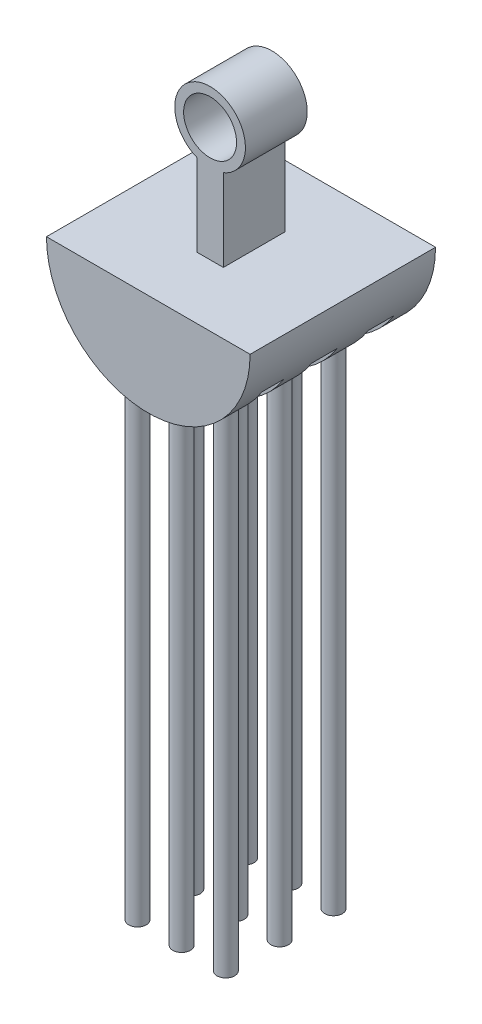
ISO-10303-21;
HEADER;
FILE_DESCRIPTION(('STEP AP214'),'2;1');
FILE_NAME('part.step','',(''),(''),'','','');
FILE_SCHEMA(('AUTOMOTIVE_DESIGN { 1 0 10303 214 1 1 1 1 }'));
ENDSEC;
DATA;
#1=APPLICATION_CONTEXT('core data for automotive mechanical design processes');
#2=APPLICATION_PROTOCOL_DEFINITION('international standard','automotive_design',2000,#1);
#3=PRODUCT_CONTEXT('',#1,'mechanical');
#4=PRODUCT('Part','Part','',(#3));
#5=PRODUCT_RELATED_PRODUCT_CATEGORY('part','',(#4));
#6=PRODUCT_DEFINITION_FORMATION('','',#4);
#7=PRODUCT_DEFINITION_CONTEXT('part definition',#1,'design');
#8=PRODUCT_DEFINITION('design','',#6,#7);
#9=PRODUCT_DEFINITION_SHAPE('','',#8);
#10=(LENGTH_UNIT() NAMED_UNIT(*) SI_UNIT(.MILLI.,.METRE.));
#11=(NAMED_UNIT(*) PLANE_ANGLE_UNIT() SI_UNIT($,.RADIAN.));
#12=(NAMED_UNIT(*) SI_UNIT($,.STERADIAN.) SOLID_ANGLE_UNIT());
#13=UNCERTAINTY_MEASURE_WITH_UNIT(LENGTH_MEASURE(1.E-05),#10,'distance_accuracy_value','');
#14=(GEOMETRIC_REPRESENTATION_CONTEXT(3) GLOBAL_UNCERTAINTY_ASSIGNED_CONTEXT((#13)) GLOBAL_UNIT_ASSIGNED_CONTEXT((#10,
#11,#12)) REPRESENTATION_CONTEXT('',''));
#15=CARTESIAN_POINT('',(0.,0.,0.));
#16=DIRECTION('',(0.,0.,1.));
#17=DIRECTION('',(1.,0.,0.));
#18=AXIS2_PLACEMENT_3D('',#15,#16,#17);
#19=CARTESIAN_POINT('',(0.,0.,7.));
#20=DIRECTION('',(0.,0.,1.));
#21=DIRECTION('',(1.,0.,0.));
#22=AXIS2_PLACEMENT_3D('',#19,#20,#21);
#23=PLANE('',#22);
#24=CARTESIAN_POINT('',(0.,0.,7.));
#25=DIRECTION('',(0.,0.,1.));
#26=DIRECTION('',(1.,0.,0.));
#27=AXIS2_PLACEMENT_3D('',#24,#25,#26);
#28=CIRCLE('',#27,4.);
#29=CARTESIAN_POINT('',(1.5,-3.70809924354783,7.));
#30=VERTEX_POINT('',#29);
#31=CARTESIAN_POINT('',(-1.5,-3.70809924354783,7.));
#32=VERTEX_POINT('',#31);
#33=EDGE_CURVE('E571',#30,#32,#28,.T.);
#34=ORIENTED_EDGE('',*,*,#33,.T.);
#35=DIRECTION('',(0.,-1.,0.));
#36=VECTOR('',#35,1.);
#37=CARTESIAN_POINT('',(-1.5,-3.,7.));
#38=LINE('',#37,#36);
#39=CARTESIAN_POINT('',(-1.5,-13.,7.));
#40=VERTEX_POINT('',#39);
#41=EDGE_CURVE('E543',#32,#40,#38,.T.);
#42=ORIENTED_EDGE('',*,*,#41,.T.);
#43=DIRECTION('',(1.,0.,0.));
#44=VECTOR('',#43,1.);
#45=CARTESIAN_POINT('',(-1.5,-13.,7.));
#46=LINE('',#45,#44);
#47=CARTESIAN_POINT('',(1.5,-13.,7.));
#48=VERTEX_POINT('',#47);
#49=EDGE_CURVE('E556',#40,#48,#46,.T.);
#50=ORIENTED_EDGE('',*,*,#49,.T.);
#51=DIRECTION('',(0.,1.,0.));
#52=VECTOR('',#51,1.);
#53=CARTESIAN_POINT('',(1.5,-13.,7.));
#54=LINE('',#53,#52);
#55=EDGE_CURVE('E549',#48,#30,#54,.T.);
#56=ORIENTED_EDGE('',*,*,#55,.T.);
#57=EDGE_LOOP('',(#34,#42,#50,#56));
#58=FACE_BOUND('',#57,.T.);
#59=CARTESIAN_POINT('',(0.,0.,7.));
#60=DIRECTION('',(0.,0.,1.));
#61=DIRECTION('',(1.,0.,0.));
#62=AXIS2_PLACEMENT_3D('',#59,#60,#61);
#63=CIRCLE('',#62,3.);
#64=CARTESIAN_POINT('',(3.,0.,7.));
#65=VERTEX_POINT('',#64);
#66=EDGE_CURVE('E565',#65,#65,#63,.T.);
#67=ORIENTED_EDGE('',*,*,#66,.F.);
#68=EDGE_LOOP('',(#67));
#69=FACE_BOUND('',#68,.T.);
#70=ADVANCED_FACE('F39',(#58,#69),#23,.T.);
#71=CARTESIAN_POINT('',(0.,0.,0.));
#72=DIRECTION('',(0.,0.,1.));
#73=DIRECTION('',(1.,0.,0.));
#74=AXIS2_PLACEMENT_3D('',#71,#72,#73);
#75=PLANE('',#74);
#76=DIRECTION('',(0.,-1.,0.));
#77=VECTOR('',#76,1.);
#78=CARTESIAN_POINT('',(-1.5,-3.,0.));
#79=LINE('',#78,#77);
#80=CARTESIAN_POINT('',(-1.5,-3.70809924354783,0.));
#81=VERTEX_POINT('',#80);
#82=CARTESIAN_POINT('',(-1.5,-13.,0.));
#83=VERTEX_POINT('',#82);
#84=EDGE_CURVE('E545',#81,#83,#79,.T.);
#85=ORIENTED_EDGE('',*,*,#84,.F.);
#86=CARTESIAN_POINT('',(0.,0.,0.));
#87=DIRECTION('',(0.,0.,1.));
#88=DIRECTION('',(1.,0.,0.));
#89=AXIS2_PLACEMENT_3D('',#86,#87,#88);
#90=CIRCLE('',#89,4.);
#91=CARTESIAN_POINT('',(1.5,-3.70809924354783,0.));
#92=VERTEX_POINT('',#91);
#93=EDGE_CURVE('E568',#92,#81,#90,.T.);
#94=ORIENTED_EDGE('',*,*,#93,.F.);
#95=DIRECTION('',(0.,1.,0.));
#96=VECTOR('',#95,1.);
#97=CARTESIAN_POINT('',(1.5,-13.,0.));
#98=LINE('',#97,#96);
#99=CARTESIAN_POINT('',(1.5,-13.,0.));
#100=VERTEX_POINT('',#99);
#101=EDGE_CURVE('E551',#100,#92,#98,.T.);
#102=ORIENTED_EDGE('',*,*,#101,.F.);
#103=DIRECTION('',(1.,0.,0.));
#104=VECTOR('',#103,1.);
#105=CARTESIAN_POINT('',(-1.5,-13.,0.));
#106=LINE('',#105,#104);
#107=EDGE_CURVE('E548',#83,#100,#106,.T.);
#108=ORIENTED_EDGE('',*,*,#107,.F.);
#109=EDGE_LOOP('',(#85,#94,#102,#108));
#110=FACE_BOUND('',#109,.T.);
#111=CARTESIAN_POINT('',(0.,0.,0.));
#112=DIRECTION('',(0.,0.,1.));
#113=DIRECTION('',(1.,0.,0.));
#114=AXIS2_PLACEMENT_3D('',#111,#112,#113);
#115=CIRCLE('',#114,3.);
#116=CARTESIAN_POINT('',(3.,0.,0.));
#117=VERTEX_POINT('',#116);
#118=EDGE_CURVE('E562',#117,#117,#115,.T.);
#119=ORIENTED_EDGE('',*,*,#118,.T.);
#120=EDGE_LOOP('',(#119));
#121=FACE_BOUND('',#120,.T.);
#122=ADVANCED_FACE('F226',(#110,#121),#75,.F.);
#123=CARTESIAN_POINT('',(0.,0.,7.));
#124=DIRECTION('',(0.,0.,-1.));
#125=DIRECTION('',(-1.,0.,0.));
#126=AXIS2_PLACEMENT_3D('',#123,#124,#125);
#127=CYLINDRICAL_SURFACE('',#126,4.);
#128=ORIENTED_EDGE('',*,*,#33,.F.);
#129=DIRECTION('',(0.,0.,-1.));
#130=VECTOR('',#129,1.);
#131=CARTESIAN_POINT('',(1.5,-3.70809924354783,7.));
#132=LINE('',#131,#130);
#133=EDGE_CURVE('E136',#30,#92,#132,.T.);
#134=ORIENTED_EDGE('',*,*,#133,.T.);
#135=ORIENTED_EDGE('',*,*,#93,.T.);
#136=DIRECTION('',(0.,0.,-1.));
#137=VECTOR('',#136,1.);
#138=CARTESIAN_POINT('',(-1.5,-3.70809924354783,7.));
#139=LINE('',#138,#137);
#140=EDGE_CURVE('E573',#81,#32,#139,.F.);
#141=ORIENTED_EDGE('',*,*,#140,.T.);
#142=EDGE_LOOP('',(#128,#134,#135,#141));
#143=FACE_BOUND('',#142,.T.);
#144=ADVANCED_FACE('F41',(#143),#127,.T.);
#145=CARTESIAN_POINT('',(0.,0.,7.));
#146=DIRECTION('',(0.,0.,-1.));
#147=DIRECTION('',(-1.,0.,0.));
#148=AXIS2_PLACEMENT_3D('',#145,#146,#147);
#149=CYLINDRICAL_SURFACE('',#148,3.);
#150=ORIENTED_EDGE('',*,*,#118,.F.);
#151=EDGE_LOOP('',(#150));
#152=FACE_BOUND('',#151,.T.);
#153=ORIENTED_EDGE('',*,*,#66,.T.);
#154=EDGE_LOOP('',(#153));
#155=FACE_BOUND('',#154,.T.);
#156=ADVANCED_FACE('F236',(#152,#155),#149,.F.);
#157=CARTESIAN_POINT('',(1.5,-13.,0.));
#158=DIRECTION('',(1.,0.,0.));
#159=DIRECTION('',(0.,0.,-1.));
#160=AXIS2_PLACEMENT_3D('',#157,#158,#159);
#161=PLANE('',#160);
#162=ORIENTED_EDGE('',*,*,#133,.F.);
#163=ORIENTED_EDGE('',*,*,#55,.F.);
#164=DIRECTION('',(0.,0.,1.));
#165=VECTOR('',#164,1.);
#166=CARTESIAN_POINT('',(1.5,-13.,0.));
#167=LINE('',#166,#165);
#168=EDGE_CURVE('E560',#100,#48,#167,.T.);
#169=ORIENTED_EDGE('',*,*,#168,.F.);
#170=ORIENTED_EDGE('',*,*,#101,.T.);
#171=EDGE_LOOP('',(#162,#163,#169,#170));
#172=FACE_BOUND('',#171,.T.);
#173=ADVANCED_FACE('F239',(#172),#161,.T.);
#174=CARTESIAN_POINT('',(-1.5,-3.,0.));
#175=DIRECTION('',(-1.,0.,0.));
#176=DIRECTION('',(0.,-1.,0.));
#177=AXIS2_PLACEMENT_3D('',#174,#175,#176);
#178=PLANE('',#177);
#179=ORIENTED_EDGE('',*,*,#140,.F.);
#180=ORIENTED_EDGE('',*,*,#84,.T.);
#181=DIRECTION('',(0.,0.,1.));
#182=VECTOR('',#181,1.);
#183=CARTESIAN_POINT('',(-1.5,-13.,0.));
#184=LINE('',#183,#182);
#185=EDGE_CURVE('E553',#83,#40,#184,.T.);
#186=ORIENTED_EDGE('',*,*,#185,.T.);
#187=ORIENTED_EDGE('',*,*,#41,.F.);
#188=EDGE_LOOP('',(#179,#180,#186,#187));
#189=FACE_BOUND('',#188,.T.);
#190=ADVANCED_FACE('F241',(#189),#178,.T.);
#191=CARTESIAN_POINT('',(1.5,-13.,-7.));
#192=DIRECTION('',(0.,1.,0.));
#193=DIRECTION('',(0.,0.,1.));
#194=AXIS2_PLACEMENT_3D('',#191,#192,#193);
#195=PLANE('',#194);
#196=ORIENTED_EDGE('',*,*,#107,.T.);
#197=ORIENTED_EDGE('',*,*,#168,.T.);
#198=ORIENTED_EDGE('',*,*,#49,.F.);
#199=ORIENTED_EDGE('',*,*,#185,.F.);
#200=EDGE_LOOP('',(#196,#197,#198,#199));
#201=FACE_BOUND('',#200,.T.);
#202=DIRECTION('',(0.,0.,1.));
#203=VECTOR('',#202,1.);
#204=CARTESIAN_POINT('',(-11.5313326284758,-13.,-7.));
#205=LINE('',#204,#203);
#206=CARTESIAN_POINT('',(-11.5313326284758,-13.,-7.));
#207=VERTEX_POINT('',#206);
#208=CARTESIAN_POINT('',(-11.5313326284758,-13.,14.));
#209=VERTEX_POINT('',#208);
#210=EDGE_CURVE('E540',#207,#209,#205,.T.);
#211=ORIENTED_EDGE('',*,*,#210,.T.);
#212=DIRECTION('',(-1.,0.,0.));
#213=VECTOR('',#212,1.);
#214=CARTESIAN_POINT('',(1.5,-13.,14.));
#215=LINE('',#214,#213);
#216=CARTESIAN_POINT('',(11.5313326284758,-13.,14.));
#217=VERTEX_POINT('',#216);
#218=EDGE_CURVE('E527',#217,#209,#215,.T.);
#219=ORIENTED_EDGE('',*,*,#218,.F.);
#220=DIRECTION('',(0.,0.,1.));
#221=VECTOR('',#220,1.);
#222=CARTESIAN_POINT('',(11.5313326284758,-13.,-7.));
#223=LINE('',#222,#221);
#224=CARTESIAN_POINT('',(11.5313326284758,-13.,-7.));
#225=VERTEX_POINT('',#224);
#226=EDGE_CURVE('E541',#225,#217,#223,.T.);
#227=ORIENTED_EDGE('',*,*,#226,.F.);
#228=DIRECTION('',(-1.,0.,0.));
#229=VECTOR('',#228,1.);
#230=CARTESIAN_POINT('',(1.5,-13.,-7.));
#231=LINE('',#230,#229);
#232=EDGE_CURVE('E535',#225,#207,#231,.T.);
#233=ORIENTED_EDGE('',*,*,#232,.T.);
#234=EDGE_LOOP('',(#211,#219,#227,#233));
#235=FACE_BOUND('',#234,.T.);
#236=ADVANCED_FACE('F244',(#201,#235),#195,.T.);
#237=CARTESIAN_POINT('',(0.,-13.,-7.));
#238=DIRECTION('',(0.,0.,1.));
#239=DIRECTION('',(1.,0.,0.));
#240=AXIS2_PLACEMENT_3D('',#237,#238,#239);
#241=CYLINDRICAL_SURFACE('',#240,11.5313326284758);
#242=CARTESIAN_POINT('',(0.,-13.,8.42029764107177));
#243=DIRECTION('',(0.,0.,-1.));
#244=DIRECTION('',(-1.,0.,0.));
#245=AXIS2_PLACEMENT_3D('',#242,#243,#244);
#246=CIRCLE('',#245,11.5313326284758);
#247=CARTESIAN_POINT('',(-9.78028790138868,-19.108813367136,8.42029764107177));
#248=VERTEX_POINT('',#247);
#249=CARTESIAN_POINT('',(9.7802879013888,-19.108813367136,8.42029764107177));
#250=VERTEX_POINT('',#249);
#251=EDGE_CURVE('E170',#248,#250,#246,.F.);
#252=ORIENTED_EDGE('',*,*,#251,.F.);
#253=DIRECTION('',(0.,0.,1.));
#254=VECTOR('',#253,1.);
#255=CARTESIAN_POINT('',(-9.78028790138873,-19.108813367136,-7.));
#256=LINE('',#255,#254);
#257=CARTESIAN_POINT('',(-9.78028790138872,-19.108813367136,10.9017251761366));
#258=VERTEX_POINT('',#257);
#259=EDGE_CURVE('E168',#258,#248,#256,.F.);
#260=ORIENTED_EDGE('',*,*,#259,.F.);
#261=CARTESIAN_POINT('',(0.,-13.,10.9017251761366));
#262=DIRECTION('',(0.,0.,-1.));
#263=DIRECTION('',(-1.,0.,0.));
#264=AXIS2_PLACEMENT_3D('',#261,#262,#263);
#265=CIRCLE('',#264,11.5313326284758);
#266=CARTESIAN_POINT('',(9.78028790138873,-19.108813367136,10.9017251761366));
#267=VERTEX_POINT('',#266);
#268=EDGE_CURVE('E163',#258,#267,#265,.F.);
#269=ORIENTED_EDGE('',*,*,#268,.T.);
#270=DIRECTION('',(0.,0.,1.));
#271=VECTOR('',#270,1.);
#272=CARTESIAN_POINT('',(9.78028790138873,-19.108813367136,-7.));
#273=LINE('',#272,#271);
#274=EDGE_CURVE('E166',#250,#267,#273,.T.);
#275=ORIENTED_EDGE('',*,*,#274,.F.);
#276=EDGE_LOOP('',(#252,#260,#269,#275));
#277=FACE_BOUND('',#276,.T.);
#278=CARTESIAN_POINT('',(0.,-13.,2.40972872280364));
#279=DIRECTION('',(0.,0.,-1.));
#280=DIRECTION('',(-1.,0.,0.));
#281=AXIS2_PLACEMENT_3D('',#278,#279,#280);
#282=CIRCLE('',#281,11.5313326284758);
#283=CARTESIAN_POINT('',(-9.78028790138868,-19.108813367136,2.40972872280364));
#284=VERTEX_POINT('',#283);
#285=CARTESIAN_POINT('',(9.7802879013888,-19.108813367136,2.40972872280364));
#286=VERTEX_POINT('',#285);
#287=EDGE_CURVE('E161',#284,#286,#282,.F.);
#288=ORIENTED_EDGE('',*,*,#287,.F.);
#289=DIRECTION('',(0.,0.,1.));
#290=VECTOR('',#289,1.);
#291=CARTESIAN_POINT('',(-9.78028790138873,-19.108813367136,-7.));
#292=LINE('',#291,#290);
#293=CARTESIAN_POINT('',(-9.78028790138872,-19.108813367136,5.27715609665633));
#294=VERTEX_POINT('',#293);
#295=EDGE_CURVE('E159',#294,#284,#292,.F.);
#296=ORIENTED_EDGE('',*,*,#295,.F.);
#297=CARTESIAN_POINT('',(0.,-13.,5.27715609665633));
#298=DIRECTION('',(0.,0.,-1.));
#299=DIRECTION('',(-1.,0.,0.));
#300=AXIS2_PLACEMENT_3D('',#297,#298,#299);
#301=CIRCLE('',#300,11.5313326284758);
#302=CARTESIAN_POINT('',(9.78028790138873,-19.108813367136,5.27715609665633));
#303=VERTEX_POINT('',#302);
#304=EDGE_CURVE('E151',#294,#303,#301,.F.);
#305=ORIENTED_EDGE('',*,*,#304,.T.);
#306=DIRECTION('',(0.,0.,1.));
#307=VECTOR('',#306,1.);
#308=CARTESIAN_POINT('',(9.78028790138873,-19.108813367136,-7.));
#309=LINE('',#308,#307);
#310=EDGE_CURVE('E157',#286,#303,#309,.T.);
#311=ORIENTED_EDGE('',*,*,#310,.F.);
#312=EDGE_LOOP('',(#288,#296,#305,#311));
#313=FACE_BOUND('',#312,.T.);
#314=CARTESIAN_POINT('',(0.,-13.,-4.0419828683649));
#315=DIRECTION('',(0.,0.,-1.));
#316=DIRECTION('',(0.,1.,0.));
#317=AXIS2_PLACEMENT_3D('',#314,#315,#316);
#318=CIRCLE('',#317,11.5313326284758);
#319=CARTESIAN_POINT('',(-9.78028790138868,-19.108813367136,-4.0419828683649));
#320=VERTEX_POINT('',#319);
#321=CARTESIAN_POINT('',(9.7802879013888,-19.108813367136,-4.0419828683649));
#322=VERTEX_POINT('',#321);
#323=EDGE_CURVE('E149',#320,#322,#318,.F.);
#324=ORIENTED_EDGE('',*,*,#323,.F.);
#325=DIRECTION('',(0.,0.,1.));
#326=VECTOR('',#325,1.);
#327=CARTESIAN_POINT('',(-9.78028790138873,-19.108813367136,-7.));
#328=LINE('',#327,#326);
#329=CARTESIAN_POINT('',(-9.78028790138872,-19.108813367136,-1.11941266039966));
#330=VERTEX_POINT('',#329);
#331=EDGE_CURVE('E141',#330,#320,#328,.F.);
#332=ORIENTED_EDGE('',*,*,#331,.F.);
#333=CARTESIAN_POINT('',(0.,-13.,-1.11941266039966));
#334=DIRECTION('',(0.,0.,-1.));
#335=DIRECTION('',(0.,1.,0.));
#336=AXIS2_PLACEMENT_3D('',#333,#334,#335);
#337=CIRCLE('',#336,11.5313326284758);
#338=CARTESIAN_POINT('',(9.78028790138873,-19.108813367136,-1.11941266039966));
#339=VERTEX_POINT('',#338);
#340=EDGE_CURVE('E127',#330,#339,#337,.F.);
#341=ORIENTED_EDGE('',*,*,#340,.T.);
#342=DIRECTION('',(0.,0.,1.));
#343=VECTOR('',#342,1.);
#344=CARTESIAN_POINT('',(9.78028790138873,-19.108813367136,-7.));
#345=LINE('',#344,#343);
#346=EDGE_CURVE('E135',#322,#339,#345,.T.);
#347=ORIENTED_EDGE('',*,*,#346,.F.);
#348=EDGE_LOOP('',(#324,#332,#341,#347));
#349=FACE_BOUND('',#348,.T.);
#350=ORIENTED_EDGE('',*,*,#226,.T.);
#351=CARTESIAN_POINT('',(0.,-13.,14.));
#352=DIRECTION('',(0.,0.,1.));
#353=DIRECTION('',(1.,0.,0.));
#354=AXIS2_PLACEMENT_3D('',#351,#352,#353);
#355=CIRCLE('',#354,11.5313326284758);
#356=EDGE_CURVE('E532',#209,#217,#355,.T.);
#357=ORIENTED_EDGE('',*,*,#356,.F.);
#358=ORIENTED_EDGE('',*,*,#210,.F.);
#359=CARTESIAN_POINT('',(0.,-13.,-7.));
#360=DIRECTION('',(0.,0.,1.));
#361=DIRECTION('',(1.,0.,0.));
#362=AXIS2_PLACEMENT_3D('',#359,#360,#361);
#363=CIRCLE('',#362,11.5313326284758);
#364=EDGE_CURVE('E537',#207,#225,#363,.T.);
#365=ORIENTED_EDGE('',*,*,#364,.T.);
#366=EDGE_LOOP('',(#350,#357,#358,#365));
#367=FACE_BOUND('',#366,.T.);
#368=ADVANCED_FACE('F147',(#277,#313,#349,#367),#241,.T.);
#369=CARTESIAN_POINT('',(0.,-13.,-7.));
#370=DIRECTION('',(0.,0.,1.));
#371=DIRECTION('',(1.,0.,0.));
#372=AXIS2_PLACEMENT_3D('',#369,#370,#371);
#373=PLANE('',#372);
#374=ORIENTED_EDGE('',*,*,#232,.F.);
#375=ORIENTED_EDGE('',*,*,#364,.F.);
#376=EDGE_LOOP('',(#374,#375));
#377=FACE_BOUND('',#376,.T.);
#378=ADVANCED_FACE('F251',(#377),#373,.F.);
#379=CARTESIAN_POINT('',(0.,-13.,14.));
#380=DIRECTION('',(0.,0.,1.));
#381=DIRECTION('',(1.,0.,0.));
#382=AXIS2_PLACEMENT_3D('',#379,#380,#381);
#383=PLANE('',#382);
#384=ORIENTED_EDGE('',*,*,#218,.T.);
#385=ORIENTED_EDGE('',*,*,#356,.T.);
#386=EDGE_LOOP('',(#384,#385));
#387=FACE_BOUND('',#386,.T.);
#388=ADVANCED_FACE('F258',(#387),#383,.T.);
#389=CARTESIAN_POINT('',(170.5,0.,-4.0419828683649));
#390=DIRECTION('',(0.,0.,-1.));
#391=DIRECTION('',(0.,1.,0.));
#392=AXIS2_PLACEMENT_3D('',#389,#390,#391);
#393=PLANE('',#392);
#394=ORIENTED_EDGE('',*,*,#323,.T.);
#395=DIRECTION('',(-1.,0.,0.));
#396=VECTOR('',#395,1.);
#397=CARTESIAN_POINT('',(170.5,-19.108813367136,-4.0419828683649));
#398=LINE('',#397,#396);
#399=EDGE_CURVE('E143',#322,#320,#398,.T.);
#400=ORIENTED_EDGE('',*,*,#399,.T.);
#401=EDGE_LOOP('',(#394,#400));
#402=FACE_BOUND('',#401,.T.);
#403=ADVANCED_FACE('F262',(#402),#393,.F.);
#404=CARTESIAN_POINT('',(170.5,-19.108813367136,0.));
#405=DIRECTION('',(0.,1.,0.));
#406=DIRECTION('',(0.,0.,1.));
#407=AXIS2_PLACEMENT_3D('',#404,#405,#406);
#408=PLANE('',#407);
#409=CARTESIAN_POINT('',(-5.48620524809585,-19.108813367136,-2.46567585443632));
#410=DIRECTION('',(0.,1.,0.));
#411=DIRECTION('',(0.,0.,1.));
#412=AXIS2_PLACEMENT_3D('',#409,#410,#411);
#413=CIRCLE('',#412,1.);
#414=CARTESIAN_POINT('',(-5.48620524809585,-19.108813367136,-1.46567585443632));
#415=VERTEX_POINT('',#414);
#416=EDGE_CURVE('E11',#415,#415,#413,.F.);
#417=ORIENTED_EDGE('',*,*,#416,.F.);
#418=EDGE_LOOP('',(#417));
#419=FACE_BOUND('',#418,.T.);
#420=CARTESIAN_POINT('',(4.51379475190415,-19.108813367136,-2.46567585443632));
#421=DIRECTION('',(0.,1.,0.));
#422=DIRECTION('',(0.,0.,1.));
#423=AXIS2_PLACEMENT_3D('',#420,#421,#422);
#424=CIRCLE('',#423,1.);
#425=CARTESIAN_POINT('',(4.51379475190415,-19.108813367136,-1.46567585443632));
#426=VERTEX_POINT('',#425);
#427=EDGE_CURVE('E190',#426,#426,#424,.F.);
#428=ORIENTED_EDGE('',*,*,#427,.F.);
#429=EDGE_LOOP('',(#428));
#430=FACE_BOUND('',#429,.T.);
#431=CARTESIAN_POINT('',(-0.486205248095848,-19.108813367136,-2.46567585443632));
#432=DIRECTION('',(0.,1.,0.));
#433=DIRECTION('',(0.,0.,1.));
#434=AXIS2_PLACEMENT_3D('',#431,#432,#433);
#435=CIRCLE('',#434,1.);
#436=CARTESIAN_POINT('',(-0.486205248095848,-19.108813367136,-1.46567585443632));
#437=VERTEX_POINT('',#436);
#438=EDGE_CURVE('E187',#437,#437,#435,.F.);
#439=ORIENTED_EDGE('',*,*,#438,.F.);
#440=EDGE_LOOP('',(#439));
#441=FACE_BOUND('',#440,.T.);
#442=ORIENTED_EDGE('',*,*,#331,.T.);
#443=ORIENTED_EDGE('',*,*,#399,.F.);
#444=ORIENTED_EDGE('',*,*,#346,.T.);
#445=DIRECTION('',(-1.,0.,0.));
#446=VECTOR('',#445,1.);
#447=CARTESIAN_POINT('',(170.5,-19.108813367136,-1.11941266039966));
#448=LINE('',#447,#446);
#449=EDGE_CURVE('E130',#339,#330,#448,.T.);
#450=ORIENTED_EDGE('',*,*,#449,.T.);
#451=EDGE_LOOP('',(#442,#443,#444,#450));
#452=FACE_BOUND('',#451,.T.);
#453=ADVANCED_FACE('F139',(#419,#430,#441,#452),#408,.F.);
#454=CARTESIAN_POINT('',(170.5,0.,-1.11941266039966));
#455=DIRECTION('',(0.,0.,-1.));
#456=DIRECTION('',(0.,1.,0.));
#457=AXIS2_PLACEMENT_3D('',#454,#455,#456);
#458=PLANE('',#457);
#459=ORIENTED_EDGE('',*,*,#449,.F.);
#460=ORIENTED_EDGE('',*,*,#340,.F.);
#461=EDGE_LOOP('',(#459,#460));
#462=FACE_BOUND('',#461,.T.);
#463=ADVANCED_FACE('F129',(#462),#458,.T.);
#464=CARTESIAN_POINT('',(170.5,0.,2.40972872280364));
#465=DIRECTION('',(0.,0.,-1.));
#466=DIRECTION('',(-1.,0.,0.));
#467=AXIS2_PLACEMENT_3D('',#464,#465,#466);
#468=PLANE('',#467);
#469=ORIENTED_EDGE('',*,*,#287,.T.);
#470=DIRECTION('',(-1.,0.,0.));
#471=VECTOR('',#470,1.);
#472=CARTESIAN_POINT('',(170.5,-19.108813367136,2.40972872280364));
#473=LINE('',#472,#471);
#474=EDGE_CURVE('E210',#286,#284,#473,.T.);
#475=ORIENTED_EDGE('',*,*,#474,.T.);
#476=EDGE_LOOP('',(#469,#475));
#477=FACE_BOUND('',#476,.T.);
#478=ADVANCED_FACE('F201',(#477),#468,.F.);
#479=CARTESIAN_POINT('',(170.5,-19.108813367136,0.));
#480=DIRECTION('',(0.,1.,0.));
#481=DIRECTION('',(0.,0.,1.));
#482=AXIS2_PLACEMENT_3D('',#479,#480,#481);
#483=PLANE('',#482);
#484=CARTESIAN_POINT('',(-5.48620524809591,-19.108813367136,3.63432414556368));
#485=DIRECTION('',(0.,1.,0.));
#486=DIRECTION('',(0.,0.,1.));
#487=AXIS2_PLACEMENT_3D('',#484,#485,#486);
#488=CIRCLE('',#487,1.);
#489=CARTESIAN_POINT('',(-5.48620524809591,-19.108813367136,4.63432414556368));
#490=VERTEX_POINT('',#489);
#491=EDGE_CURVE('E47',#490,#490,#488,.F.);
#492=ORIENTED_EDGE('',*,*,#491,.F.);
#493=EDGE_LOOP('',(#492));
#494=FACE_BOUND('',#493,.T.);
#495=CARTESIAN_POINT('',(4.51379475190409,-19.108813367136,3.63432414556368));
#496=DIRECTION('',(0.,1.,0.));
#497=DIRECTION('',(0.,0.,1.));
#498=AXIS2_PLACEMENT_3D('',#495,#496,#497);
#499=CIRCLE('',#498,1.);
#500=CARTESIAN_POINT('',(4.51379475190409,-19.108813367136,4.63432414556368));
#501=VERTEX_POINT('',#500);
#502=EDGE_CURVE('E184',#501,#501,#499,.F.);
#503=ORIENTED_EDGE('',*,*,#502,.F.);
#504=EDGE_LOOP('',(#503));
#505=FACE_BOUND('',#504,.T.);
#506=CARTESIAN_POINT('',(-0.486205248095911,-19.108813367136,3.63432414556368));
#507=DIRECTION('',(0.,1.,0.));
#508=DIRECTION('',(0.,0.,1.));
#509=AXIS2_PLACEMENT_3D('',#506,#507,#508);
#510=CIRCLE('',#509,1.);
#511=CARTESIAN_POINT('',(-0.486205248095911,-19.108813367136,4.63432414556368));
#512=VERTEX_POINT('',#511);
#513=EDGE_CURVE('E181',#512,#512,#510,.F.);
#514=ORIENTED_EDGE('',*,*,#513,.F.);
#515=EDGE_LOOP('',(#514));
#516=FACE_BOUND('',#515,.T.);
#517=ORIENTED_EDGE('',*,*,#295,.T.);
#518=ORIENTED_EDGE('',*,*,#474,.F.);
#519=ORIENTED_EDGE('',*,*,#310,.T.);
#520=DIRECTION('',(-1.,0.,0.));
#521=VECTOR('',#520,1.);
#522=CARTESIAN_POINT('',(170.5,-19.108813367136,5.27715609665633));
#523=LINE('',#522,#521);
#524=EDGE_CURVE('E60',#303,#294,#523,.T.);
#525=ORIENTED_EDGE('',*,*,#524,.T.);
#526=EDGE_LOOP('',(#517,#518,#519,#525));
#527=FACE_BOUND('',#526,.T.);
#528=ADVANCED_FACE('F197',(#494,#505,#516,#527),#483,.F.);
#529=CARTESIAN_POINT('',(170.5,0.,5.27715609665633));
#530=DIRECTION('',(0.,0.,-1.));
#531=DIRECTION('',(-1.,0.,0.));
#532=AXIS2_PLACEMENT_3D('',#529,#530,#531);
#533=PLANE('',#532);
#534=ORIENTED_EDGE('',*,*,#524,.F.);
#535=ORIENTED_EDGE('',*,*,#304,.F.);
#536=EDGE_LOOP('',(#534,#535));
#537=FACE_BOUND('',#536,.T.);
#538=ADVANCED_FACE('F200',(#537),#533,.T.);
#539=CARTESIAN_POINT('',(170.5,0.,8.42029764107177));
#540=DIRECTION('',(0.,0.,-1.));
#541=DIRECTION('',(-1.,0.,0.));
#542=AXIS2_PLACEMENT_3D('',#539,#540,#541);
#543=PLANE('',#542);
#544=ORIENTED_EDGE('',*,*,#251,.T.);
#545=DIRECTION('',(-1.,0.,0.));
#546=VECTOR('',#545,1.);
#547=CARTESIAN_POINT('',(170.5,-19.108813367136,8.42029764107177));
#548=LINE('',#547,#546);
#549=EDGE_CURVE('E524',#250,#248,#548,.T.);
#550=ORIENTED_EDGE('',*,*,#549,.T.);
#551=EDGE_LOOP('',(#544,#550));
#552=FACE_BOUND('',#551,.T.);
#553=ADVANCED_FACE('F217',(#552),#543,.F.);
#554=CARTESIAN_POINT('',(170.5,-19.108813367136,0.));
#555=DIRECTION('',(0.,1.,0.));
#556=DIRECTION('',(0.,0.,1.));
#557=AXIS2_PLACEMENT_3D('',#554,#555,#556);
#558=PLANE('',#557);
#559=CARTESIAN_POINT('',(4.51379475190403,-19.108813367136,9.73432414556367));
#560=DIRECTION('',(0.,1.,0.));
#561=DIRECTION('',(0.,0.,1.));
#562=AXIS2_PLACEMENT_3D('',#559,#560,#561);
#563=CIRCLE('',#562,1.);
#564=CARTESIAN_POINT('',(4.51379475190403,-19.108813367136,10.7343241455637));
#565=VERTEX_POINT('',#564);
#566=EDGE_CURVE('E178',#565,#565,#563,.F.);
#567=ORIENTED_EDGE('',*,*,#566,.F.);
#568=EDGE_LOOP('',(#567));
#569=FACE_BOUND('',#568,.T.);
#570=CARTESIAN_POINT('',(-0.486205248095974,-19.108813367136,9.73432414556367));
#571=DIRECTION('',(0.,1.,0.));
#572=DIRECTION('',(0.,0.,1.));
#573=AXIS2_PLACEMENT_3D('',#570,#571,#572);
#574=CIRCLE('',#573,1.);
#575=CARTESIAN_POINT('',(-0.486205248095974,-19.108813367136,10.7343241455637));
#576=VERTEX_POINT('',#575);
#577=EDGE_CURVE('E175',#576,#576,#574,.F.);
#578=ORIENTED_EDGE('',*,*,#577,.F.);
#579=EDGE_LOOP('',(#578));
#580=FACE_BOUND('',#579,.T.);
#581=CARTESIAN_POINT('',(-5.48620524809597,-19.108813367136,9.73432414556367));
#582=DIRECTION('',(0.,1.,0.));
#583=DIRECTION('',(0.,0.,1.));
#584=AXIS2_PLACEMENT_3D('',#581,#582,#583);
#585=CIRCLE('',#584,1.);
#586=CARTESIAN_POINT('',(-5.48620524809597,-19.108813367136,10.7343241455637));
#587=VERTEX_POINT('',#586);
#588=EDGE_CURVE('E172',#587,#587,#585,.F.);
#589=ORIENTED_EDGE('',*,*,#588,.F.);
#590=EDGE_LOOP('',(#589));
#591=FACE_BOUND('',#590,.T.);
#592=ORIENTED_EDGE('',*,*,#259,.T.);
#593=ORIENTED_EDGE('',*,*,#549,.F.);
#594=ORIENTED_EDGE('',*,*,#274,.T.);
#595=DIRECTION('',(-1.,0.,0.));
#596=VECTOR('',#595,1.);
#597=CARTESIAN_POINT('',(170.5,-19.108813367136,10.9017251761366));
#598=LINE('',#597,#596);
#599=EDGE_CURVE('E53',#267,#258,#598,.T.);
#600=ORIENTED_EDGE('',*,*,#599,.T.);
#601=EDGE_LOOP('',(#592,#593,#594,#600));
#602=FACE_BOUND('',#601,.T.);
#603=ADVANCED_FACE('F222',(#569,#580,#591,#602),#558,.F.);
#604=CARTESIAN_POINT('',(170.5,0.,10.9017251761366));
#605=DIRECTION('',(0.,0.,-1.));
#606=DIRECTION('',(-1.,0.,0.));
#607=AXIS2_PLACEMENT_3D('',#604,#605,#606);
#608=PLANE('',#607);
#609=ORIENTED_EDGE('',*,*,#599,.F.);
#610=ORIENTED_EDGE('',*,*,#268,.F.);
#611=EDGE_LOOP('',(#609,#610));
#612=FACE_BOUND('',#611,.T.);
#613=ADVANCED_FACE('F295',(#612),#608,.T.);
#614=CARTESIAN_POINT('',(-5.48620524809597,-79.108813367136,9.73432414556367));
#615=DIRECTION('',(0.,1.,0.));
#616=DIRECTION('',(0.,0.,1.));
#617=AXIS2_PLACEMENT_3D('',#614,#615,#616);
#618=CYLINDRICAL_SURFACE('',#617,1.);
#619=CARTESIAN_POINT('',(-5.48620524809597,-79.108813367136,9.73432414556367));
#620=DIRECTION('',(0.,-1.,0.));
#621=DIRECTION('',(0.,0.,-1.));
#622=AXIS2_PLACEMENT_3D('',#619,#620,#621);
#623=CIRCLE('',#622,1.);
#624=CARTESIAN_POINT('',(-5.48620524809597,-79.108813367136,8.73432414556367));
#625=VERTEX_POINT('',#624);
#626=EDGE_CURVE('E144',#625,#625,#623,.T.);
#627=ORIENTED_EDGE('',*,*,#626,.F.);
#628=EDGE_LOOP('',(#627));
#629=FACE_BOUND('',#628,.T.);
#630=ORIENTED_EDGE('',*,*,#588,.T.);
#631=EDGE_LOOP('',(#630));
#632=FACE_BOUND('',#631,.T.);
#633=ADVANCED_FACE('F304',(#629,#632),#618,.T.);
#634=CARTESIAN_POINT('',(-5.48620524809597,-79.108813367136,9.73432414556367));
#635=DIRECTION('',(0.,-1.,0.));
#636=DIRECTION('',(0.,0.,-1.));
#637=AXIS2_PLACEMENT_3D('',#634,#635,#636);
#638=PLANE('',#637);
#639=ORIENTED_EDGE('',*,*,#626,.T.);
#640=EDGE_LOOP('',(#639));
#641=FACE_BOUND('',#640,.T.);
#642=ADVANCED_FACE('F309',(#641),#638,.T.);
#643=CARTESIAN_POINT('',(-0.486205248095974,-79.108813367136,9.73432414556367));
#644=DIRECTION('',(0.,1.,0.));
#645=DIRECTION('',(0.,0.,1.));
#646=AXIS2_PLACEMENT_3D('',#643,#644,#645);
#647=CYLINDRICAL_SURFACE('',#646,1.);
#648=CARTESIAN_POINT('',(-0.486205248095974,-79.108813367136,9.73432414556367));
#649=DIRECTION('',(0.,-1.,0.));
#650=DIRECTION('',(0.,0.,-1.));
#651=AXIS2_PLACEMENT_3D('',#648,#649,#650);
#652=CIRCLE('',#651,1.);
#653=CARTESIAN_POINT('',(-0.486205248095974,-79.108813367136,8.73432414556367));
#654=VERTEX_POINT('',#653);
#655=EDGE_CURVE('E518',#654,#654,#652,.T.);
#656=ORIENTED_EDGE('',*,*,#655,.F.);
#657=EDGE_LOOP('',(#656));
#658=FACE_BOUND('',#657,.T.);
#659=ORIENTED_EDGE('',*,*,#577,.T.);
#660=EDGE_LOOP('',(#659));
#661=FACE_BOUND('',#660,.T.);
#662=ADVANCED_FACE('F319',(#658,#661),#647,.T.);
#663=CARTESIAN_POINT('',(-0.486205248095974,-79.108813367136,9.73432414556367));
#664=DIRECTION('',(0.,-1.,0.));
#665=DIRECTION('',(0.,0.,-1.));
#666=AXIS2_PLACEMENT_3D('',#663,#664,#665);
#667=PLANE('',#666);
#668=ORIENTED_EDGE('',*,*,#655,.T.);
#669=EDGE_LOOP('',(#668));
#670=FACE_BOUND('',#669,.T.);
#671=ADVANCED_FACE('F329',(#670),#667,.T.);
#672=CARTESIAN_POINT('',(4.51379475190403,-79.108813367136,9.73432414556367));
#673=DIRECTION('',(0.,1.,0.));
#674=DIRECTION('',(0.,0.,1.));
#675=AXIS2_PLACEMENT_3D('',#672,#673,#674);
#676=CYLINDRICAL_SURFACE('',#675,1.);
#677=CARTESIAN_POINT('',(4.51379475190403,-79.108813367136,9.73432414556367));
#678=DIRECTION('',(0.,-1.,0.));
#679=DIRECTION('',(0.,0.,-1.));
#680=AXIS2_PLACEMENT_3D('',#677,#678,#679);
#681=CIRCLE('',#680,1.);
#682=CARTESIAN_POINT('',(4.51379475190403,-79.108813367136,8.73432414556367));
#683=VERTEX_POINT('',#682);
#684=EDGE_CURVE('E515',#683,#683,#681,.T.);
#685=ORIENTED_EDGE('',*,*,#684,.F.);
#686=EDGE_LOOP('',(#685));
#687=FACE_BOUND('',#686,.T.);
#688=ORIENTED_EDGE('',*,*,#566,.T.);
#689=EDGE_LOOP('',(#688));
#690=FACE_BOUND('',#689,.T.);
#691=ADVANCED_FACE('F339',(#687,#690),#676,.T.);
#692=CARTESIAN_POINT('',(4.51379475190403,-79.108813367136,9.73432414556367));
#693=DIRECTION('',(0.,-1.,0.));
#694=DIRECTION('',(0.,0.,-1.));
#695=AXIS2_PLACEMENT_3D('',#692,#693,#694);
#696=PLANE('',#695);
#697=ORIENTED_EDGE('',*,*,#684,.T.);
#698=EDGE_LOOP('',(#697));
#699=FACE_BOUND('',#698,.T.);
#700=ADVANCED_FACE('F349',(#699),#696,.T.);
#701=CARTESIAN_POINT('',(-0.486205248095911,-79.108813367136,3.63432414556368));
#702=DIRECTION('',(0.,1.,0.));
#703=DIRECTION('',(0.,0.,1.));
#704=AXIS2_PLACEMENT_3D('',#701,#702,#703);
#705=CYLINDRICAL_SURFACE('',#704,1.);
#706=CARTESIAN_POINT('',(-0.486205248095911,-79.108813367136,3.63432414556368));
#707=DIRECTION('',(0.,-1.,0.));
#708=DIRECTION('',(0.,0.,-1.));
#709=AXIS2_PLACEMENT_3D('',#706,#707,#708);
#710=CIRCLE('',#709,1.);
#711=CARTESIAN_POINT('',(-0.486205248095911,-79.108813367136,2.63432414556368));
#712=VERTEX_POINT('',#711);
#713=EDGE_CURVE('E512',#712,#712,#710,.T.);
#714=ORIENTED_EDGE('',*,*,#713,.F.);
#715=EDGE_LOOP('',(#714));
#716=FACE_BOUND('',#715,.T.);
#717=ORIENTED_EDGE('',*,*,#513,.T.);
#718=EDGE_LOOP('',(#717));
#719=FACE_BOUND('',#718,.T.);
#720=ADVANCED_FACE('F359',(#716,#719),#705,.T.);
#721=CARTESIAN_POINT('',(-0.486205248095911,-79.108813367136,3.63432414556368));
#722=DIRECTION('',(0.,-1.,0.));
#723=DIRECTION('',(0.,0.,-1.));
#724=AXIS2_PLACEMENT_3D('',#721,#722,#723);
#725=PLANE('',#724);
#726=ORIENTED_EDGE('',*,*,#713,.T.);
#727=EDGE_LOOP('',(#726));
#728=FACE_BOUND('',#727,.T.);
#729=ADVANCED_FACE('F369',(#728),#725,.T.);
#730=CARTESIAN_POINT('',(4.51379475190409,-79.108813367136,3.63432414556368));
#731=DIRECTION('',(0.,1.,0.));
#732=DIRECTION('',(0.,0.,1.));
#733=AXIS2_PLACEMENT_3D('',#730,#731,#732);
#734=CYLINDRICAL_SURFACE('',#733,1.);
#735=CARTESIAN_POINT('',(4.51379475190409,-79.108813367136,3.63432414556368));
#736=DIRECTION('',(0.,-1.,0.));
#737=DIRECTION('',(0.,0.,-1.));
#738=AXIS2_PLACEMENT_3D('',#735,#736,#737);
#739=CIRCLE('',#738,1.);
#740=CARTESIAN_POINT('',(4.51379475190409,-79.108813367136,2.63432414556368));
#741=VERTEX_POINT('',#740);
#742=EDGE_CURVE('E509',#741,#741,#739,.T.);
#743=ORIENTED_EDGE('',*,*,#742,.F.);
#744=EDGE_LOOP('',(#743));
#745=FACE_BOUND('',#744,.T.);
#746=ORIENTED_EDGE('',*,*,#502,.T.);
#747=EDGE_LOOP('',(#746));
#748=FACE_BOUND('',#747,.T.);
#749=ADVANCED_FACE('F379',(#745,#748),#734,.T.);
#750=CARTESIAN_POINT('',(4.51379475190409,-79.108813367136,3.63432414556368));
#751=DIRECTION('',(0.,-1.,0.));
#752=DIRECTION('',(0.,0.,-1.));
#753=AXIS2_PLACEMENT_3D('',#750,#751,#752);
#754=PLANE('',#753);
#755=ORIENTED_EDGE('',*,*,#742,.T.);
#756=EDGE_LOOP('',(#755));
#757=FACE_BOUND('',#756,.T.);
#758=ADVANCED_FACE('F389',(#757),#754,.T.);
#759=CARTESIAN_POINT('',(-0.486205248095848,-79.108813367136,-2.46567585443632));
#760=DIRECTION('',(0.,1.,0.));
#761=DIRECTION('',(0.,0.,1.));
#762=AXIS2_PLACEMENT_3D('',#759,#760,#761);
#763=CYLINDRICAL_SURFACE('',#762,1.);
#764=CARTESIAN_POINT('',(-0.486205248095848,-79.108813367136,-2.46567585443632));
#765=DIRECTION('',(0.,-1.,0.));
#766=DIRECTION('',(0.,0.,-1.));
#767=AXIS2_PLACEMENT_3D('',#764,#765,#766);
#768=CIRCLE('',#767,1.);
#769=CARTESIAN_POINT('',(-0.486205248095848,-79.108813367136,-3.46567585443632));
#770=VERTEX_POINT('',#769);
#771=EDGE_CURVE('E506',#770,#770,#768,.T.);
#772=ORIENTED_EDGE('',*,*,#771,.F.);
#773=EDGE_LOOP('',(#772));
#774=FACE_BOUND('',#773,.T.);
#775=ORIENTED_EDGE('',*,*,#438,.T.);
#776=EDGE_LOOP('',(#775));
#777=FACE_BOUND('',#776,.T.);
#778=ADVANCED_FACE('F399',(#774,#777),#763,.T.);
#779=CARTESIAN_POINT('',(-0.486205248095848,-79.108813367136,-2.46567585443632));
#780=DIRECTION('',(0.,-1.,0.));
#781=DIRECTION('',(0.,0.,-1.));
#782=AXIS2_PLACEMENT_3D('',#779,#780,#781);
#783=PLANE('',#782);
#784=ORIENTED_EDGE('',*,*,#771,.T.);
#785=EDGE_LOOP('',(#784));
#786=FACE_BOUND('',#785,.T.);
#787=ADVANCED_FACE('F409',(#786),#783,.T.);
#788=CARTESIAN_POINT('',(4.51379475190415,-79.108813367136,-2.46567585443632));
#789=DIRECTION('',(0.,1.,0.));
#790=DIRECTION('',(0.,0.,1.));
#791=AXIS2_PLACEMENT_3D('',#788,#789,#790);
#792=CYLINDRICAL_SURFACE('',#791,1.);
#793=CARTESIAN_POINT('',(4.51379475190415,-79.108813367136,-2.46567585443632));
#794=DIRECTION('',(0.,-1.,0.));
#795=DIRECTION('',(0.,0.,-1.));
#796=AXIS2_PLACEMENT_3D('',#793,#794,#795);
#797=CIRCLE('',#796,1.);
#798=CARTESIAN_POINT('',(4.51379475190415,-79.108813367136,-3.46567585443632));
#799=VERTEX_POINT('',#798);
#800=EDGE_CURVE('E501',#799,#799,#797,.T.);
#801=ORIENTED_EDGE('',*,*,#800,.F.);
#802=EDGE_LOOP('',(#801));
#803=FACE_BOUND('',#802,.T.);
#804=ORIENTED_EDGE('',*,*,#427,.T.);
#805=EDGE_LOOP('',(#804));
#806=FACE_BOUND('',#805,.T.);
#807=ADVANCED_FACE('F419',(#803,#806),#792,.T.);
#808=CARTESIAN_POINT('',(4.51379475190415,-79.108813367136,-2.46567585443632));
#809=DIRECTION('',(0.,-1.,0.));
#810=DIRECTION('',(0.,0.,-1.));
#811=AXIS2_PLACEMENT_3D('',#808,#809,#810);
#812=PLANE('',#811);
#813=ORIENTED_EDGE('',*,*,#800,.T.);
#814=EDGE_LOOP('',(#813));
#815=FACE_BOUND('',#814,.T.);
#816=ADVANCED_FACE('F429',(#815),#812,.T.);
#817=CARTESIAN_POINT('',(-5.48620524809591,-79.108813367136,3.63432414556368));
#818=DIRECTION('',(0.,1.,0.));
#819=DIRECTION('',(0.,0.,1.));
#820=AXIS2_PLACEMENT_3D('',#817,#818,#819);
#821=CYLINDRICAL_SURFACE('',#820,1.);
#822=CARTESIAN_POINT('',(-5.48620524809591,-79.108813367136,3.63432414556368));
#823=DIRECTION('',(0.,-1.,0.));
#824=DIRECTION('',(0.,0.,-1.));
#825=AXIS2_PLACEMENT_3D('',#822,#823,#824);
#826=CIRCLE('',#825,1.);
#827=CARTESIAN_POINT('',(-5.48620524809591,-79.108813367136,2.63432414556368));
#828=VERTEX_POINT('',#827);
#829=EDGE_CURVE('E498',#828,#828,#826,.T.);
#830=ORIENTED_EDGE('',*,*,#829,.F.);
#831=EDGE_LOOP('',(#830));
#832=FACE_BOUND('',#831,.T.);
#833=ORIENTED_EDGE('',*,*,#491,.T.);
#834=EDGE_LOOP('',(#833));
#835=FACE_BOUND('',#834,.T.);
#836=ADVANCED_FACE('F195',(#832,#835),#821,.T.);
#837=CARTESIAN_POINT('',(-5.48620524809591,-79.108813367136,3.63432414556368));
#838=DIRECTION('',(0.,-1.,0.));
#839=DIRECTION('',(0.,0.,-1.));
#840=AXIS2_PLACEMENT_3D('',#837,#838,#839);
#841=PLANE('',#840);
#842=ORIENTED_EDGE('',*,*,#829,.T.);
#843=EDGE_LOOP('',(#842));
#844=FACE_BOUND('',#843,.T.);
#845=ADVANCED_FACE('F448',(#844),#841,.T.);
#846=CARTESIAN_POINT('',(-5.48620524809585,-79.108813367136,-2.46567585443632));
#847=DIRECTION('',(0.,1.,0.));
#848=DIRECTION('',(0.,0.,1.));
#849=AXIS2_PLACEMENT_3D('',#846,#847,#848);
#850=CYLINDRICAL_SURFACE('',#849,1.);
#851=CARTESIAN_POINT('',(-5.48620524809585,-79.108813367136,-2.46567585443632));
#852=DIRECTION('',(0.,-1.,0.));
#853=DIRECTION('',(0.,0.,-1.));
#854=AXIS2_PLACEMENT_3D('',#851,#852,#853);
#855=CIRCLE('',#854,1.);
#856=CARTESIAN_POINT('',(-5.48620524809585,-79.108813367136,-3.46567585443632));
#857=VERTEX_POINT('',#856);
#858=EDGE_CURVE('E497',#857,#857,#855,.T.);
#859=ORIENTED_EDGE('',*,*,#858,.F.);
#860=EDGE_LOOP('',(#859));
#861=FACE_BOUND('',#860,.T.);
#862=ORIENTED_EDGE('',*,*,#416,.T.);
#863=EDGE_LOOP('',(#862));
#864=FACE_BOUND('',#863,.T.);
#865=ADVANCED_FACE('F458',(#861,#864),#850,.T.);
#866=CARTESIAN_POINT('',(-5.48620524809585,-79.108813367136,-2.46567585443632));
#867=DIRECTION('',(0.,-1.,0.));
#868=DIRECTION('',(0.,0.,-1.));
#869=AXIS2_PLACEMENT_3D('',#866,#867,#868);
#870=PLANE('',#869);
#871=ORIENTED_EDGE('',*,*,#858,.T.);
#872=EDGE_LOOP('',(#871));
#873=FACE_BOUND('',#872,.T.);
#874=ADVANCED_FACE('F468',(#873),#870,.T.);
#875=CLOSED_SHELL('',(#70,#122,#144,#156,#173,#190,#236,#368,#378,#388,#403,#453,#463,#478,#528,
#538,#553,#603,#613,#633,#642,#662,#671,#691,#700,#720,#729,#749,#758,#778,#787,#807,#816,#836,
#845,#865,#874));
#876=MANIFOLD_SOLID_BREP('B2',#875);
#877=ADVANCED_BREP_SHAPE_REPRESENTATION('',(#18,#876),#14);
#878=SHAPE_DEFINITION_REPRESENTATION(#9,#877);
ENDSEC;
END-ISO-10303-21;
